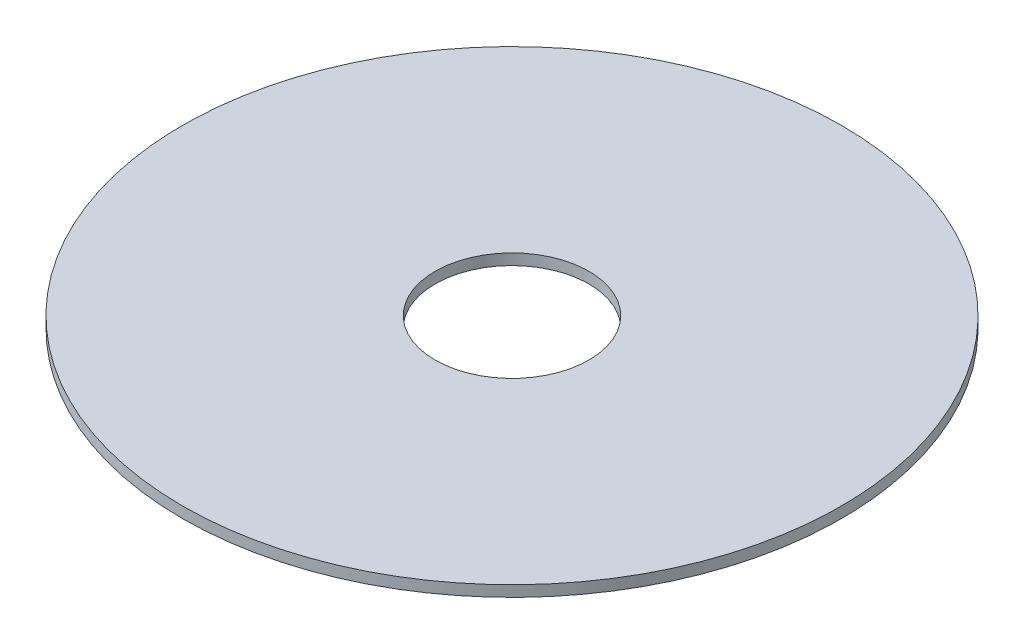
ISO-10303-21;
HEADER;
FILE_DESCRIPTION(('STEP AP214'),'2;1');
FILE_NAME('part.step','',(''),(''),'','','');
FILE_SCHEMA(('AUTOMOTIVE_DESIGN { 1 0 10303 214 1 1 1 1 }'));
ENDSEC;
DATA;
#1=APPLICATION_CONTEXT('core data for automotive mechanical design processes');
#2=APPLICATION_PROTOCOL_DEFINITION('international standard','automotive_design',2000,#1);
#3=PRODUCT_CONTEXT('',#1,'mechanical');
#4=PRODUCT('Part','Part','',(#3));
#5=PRODUCT_RELATED_PRODUCT_CATEGORY('part','',(#4));
#6=PRODUCT_DEFINITION_FORMATION('','',#4);
#7=PRODUCT_DEFINITION_CONTEXT('part definition',#1,'design');
#8=PRODUCT_DEFINITION('design','',#6,#7);
#9=PRODUCT_DEFINITION_SHAPE('','',#8);
#10=(LENGTH_UNIT() NAMED_UNIT(*) SI_UNIT(.MILLI.,.METRE.));
#11=(NAMED_UNIT(*) PLANE_ANGLE_UNIT() SI_UNIT($,.RADIAN.));
#12=(NAMED_UNIT(*) SI_UNIT($,.STERADIAN.) SOLID_ANGLE_UNIT());
#13=UNCERTAINTY_MEASURE_WITH_UNIT(LENGTH_MEASURE(1.E-05),#10,'distance_accuracy_value','');
#14=(GEOMETRIC_REPRESENTATION_CONTEXT(3) GLOBAL_UNCERTAINTY_ASSIGNED_CONTEXT((#13)) GLOBAL_UNIT_ASSIGNED_CONTEXT((#10,
#11,#12)) REPRESENTATION_CONTEXT('',''));
#15=CARTESIAN_POINT('',(0.,0.,0.));
#16=DIRECTION('',(0.,0.,1.));
#17=DIRECTION('',(1.,0.,0.));
#18=AXIS2_PLACEMENT_3D('',#15,#16,#17);
#19=CARTESIAN_POINT('',(0.,0.5,0.));
#20=DIRECTION('',(0.,1.,0.));
#21=DIRECTION('',(0.,0.,1.));
#22=AXIS2_PLACEMENT_3D('',#19,#20,#21);
#23=PLANE('',#22);
#24=CARTESIAN_POINT('',(0.,0.5,0.));
#25=DIRECTION('',(0.,1.,0.));
#26=DIRECTION('',(0.,0.,1.));
#27=AXIS2_PLACEMENT_3D('',#24,#25,#26);
#28=CIRCLE('',#27,15.);
#29=CARTESIAN_POINT('',(0.,0.5,15.));
#30=VERTEX_POINT('',#29);
#31=EDGE_CURVE('E10',#30,#30,#28,.T.);
#32=ORIENTED_EDGE('',*,*,#31,.T.);
#33=EDGE_LOOP('',(#32));
#34=FACE_BOUND('',#33,.T.);
#35=CARTESIAN_POINT('',(0.,0.5,0.));
#36=DIRECTION('',(0.,1.,0.));
#37=DIRECTION('',(0.,0.,1.));
#38=AXIS2_PLACEMENT_3D('',#35,#36,#37);
#39=CIRCLE('',#38,3.5);
#40=CARTESIAN_POINT('',(0.,0.5,3.5));
#41=VERTEX_POINT('',#40);
#42=EDGE_CURVE('E41',#41,#41,#39,.T.);
#43=ORIENTED_EDGE('',*,*,#42,.F.);
#44=EDGE_LOOP('',(#43));
#45=FACE_BOUND('',#44,.T.);
#46=ADVANCED_FACE('F30',(#34,#45),#23,.T.);
#47=CARTESIAN_POINT('',(0.,0.,0.));
#48=DIRECTION('',(0.,1.,0.));
#49=DIRECTION('',(0.,0.,1.));
#50=AXIS2_PLACEMENT_3D('',#47,#48,#49);
#51=PLANE('',#50);
#52=CARTESIAN_POINT('',(0.,0.,0.));
#53=DIRECTION('',(0.,1.,0.));
#54=DIRECTION('',(0.,0.,1.));
#55=AXIS2_PLACEMENT_3D('',#52,#53,#54);
#56=CIRCLE('',#55,15.);
#57=CARTESIAN_POINT('',(0.,0.,15.));
#58=VERTEX_POINT('',#57);
#59=EDGE_CURVE('E34',#58,#58,#56,.T.);
#60=ORIENTED_EDGE('',*,*,#59,.F.);
#61=EDGE_LOOP('',(#60));
#62=FACE_BOUND('',#61,.T.);
#63=CARTESIAN_POINT('',(0.,0.,0.));
#64=DIRECTION('',(0.,1.,0.));
#65=DIRECTION('',(0.,0.,1.));
#66=AXIS2_PLACEMENT_3D('',#63,#64,#65);
#67=CIRCLE('',#66,3.5);
#68=CARTESIAN_POINT('',(0.,0.,3.5));
#69=VERTEX_POINT('',#68);
#70=EDGE_CURVE('E43',#69,#69,#67,.T.);
#71=ORIENTED_EDGE('',*,*,#70,.T.);
#72=EDGE_LOOP('',(#71));
#73=FACE_BOUND('',#72,.T.);
#74=ADVANCED_FACE('F53',(#62,#73),#51,.F.);
#75=CARTESIAN_POINT('',(0.,0.5,0.));
#76=DIRECTION('',(0.,-1.,0.));
#77=DIRECTION('',(0.,0.,-1.));
#78=AXIS2_PLACEMENT_3D('',#75,#76,#77);
#79=CYLINDRICAL_SURFACE('',#78,15.);
#80=ORIENTED_EDGE('',*,*,#31,.F.);
#81=EDGE_LOOP('',(#80));
#82=FACE_BOUND('',#81,.T.);
#83=ORIENTED_EDGE('',*,*,#59,.T.);
#84=EDGE_LOOP('',(#83));
#85=FACE_BOUND('',#84,.T.);
#86=ADVANCED_FACE('F32',(#82,#85),#79,.T.);
#87=CARTESIAN_POINT('',(0.,0.5,0.));
#88=DIRECTION('',(0.,-1.,0.));
#89=DIRECTION('',(0.,0.,-1.));
#90=AXIS2_PLACEMENT_3D('',#87,#88,#89);
#91=CYLINDRICAL_SURFACE('',#90,3.5);
#92=ORIENTED_EDGE('',*,*,#42,.T.);
#93=EDGE_LOOP('',(#92));
#94=FACE_BOUND('',#93,.T.);
#95=ORIENTED_EDGE('',*,*,#70,.F.);
#96=EDGE_LOOP('',(#95));
#97=FACE_BOUND('',#96,.T.);
#98=ADVANCED_FACE('F49',(#94,#97),#91,.F.);
#99=CLOSED_SHELL('',(#46,#74,#86,#98));
#100=MANIFOLD_SOLID_BREP('B2',#99);
#101=ADVANCED_BREP_SHAPE_REPRESENTATION('',(#18,#100),#14);
#102=SHAPE_DEFINITION_REPRESENTATION(#9,#101);
ENDSEC;
END-ISO-10303-21;
